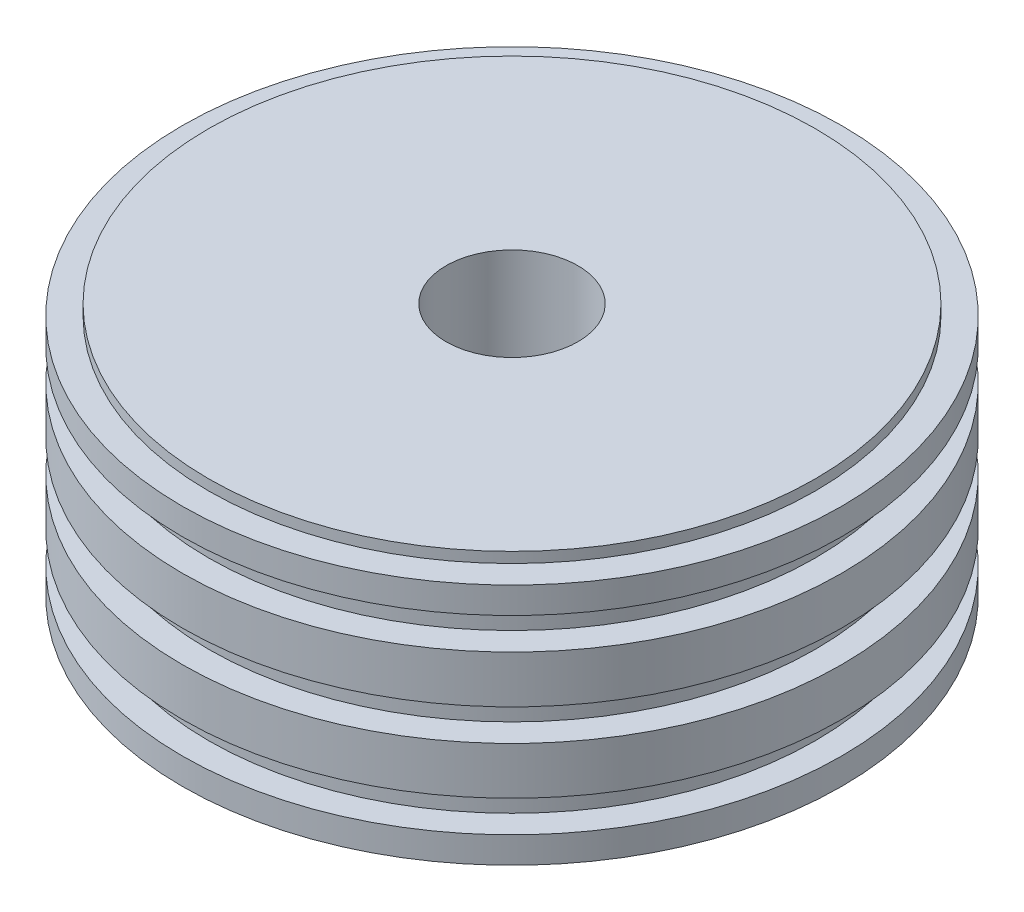
ISO-10303-21;
HEADER;
FILE_DESCRIPTION(('STEP AP214'),'2;1');
FILE_NAME('part.step','',(''),(''),'','','');
FILE_SCHEMA(('AUTOMOTIVE_DESIGN { 1 0 10303 214 1 1 1 1 }'));
ENDSEC;
DATA;
#1=APPLICATION_CONTEXT('core data for automotive mechanical design processes');
#2=APPLICATION_PROTOCOL_DEFINITION('international standard','automotive_design',2000,#1);
#3=PRODUCT_CONTEXT('',#1,'mechanical');
#4=PRODUCT('Part','Part','',(#3));
#5=PRODUCT_RELATED_PRODUCT_CATEGORY('part','',(#4));
#6=PRODUCT_DEFINITION_FORMATION('','',#4);
#7=PRODUCT_DEFINITION_CONTEXT('part definition',#1,'design');
#8=PRODUCT_DEFINITION('design','',#6,#7);
#9=PRODUCT_DEFINITION_SHAPE('','',#8);
#10=(LENGTH_UNIT() NAMED_UNIT(*) SI_UNIT(.MILLI.,.METRE.));
#11=(NAMED_UNIT(*) PLANE_ANGLE_UNIT() SI_UNIT($,.RADIAN.));
#12=(NAMED_UNIT(*) SI_UNIT($,.STERADIAN.) SOLID_ANGLE_UNIT());
#13=UNCERTAINTY_MEASURE_WITH_UNIT(LENGTH_MEASURE(1.E-05),#10,'distance_accuracy_value','');
#14=(GEOMETRIC_REPRESENTATION_CONTEXT(3) GLOBAL_UNCERTAINTY_ASSIGNED_CONTEXT((#13)) GLOBAL_UNIT_ASSIGNED_CONTEXT((#10,
#11,#12)) REPRESENTATION_CONTEXT('',''));
#15=CARTESIAN_POINT('',(0.,0.,0.));
#16=DIRECTION('',(0.,0.,1.));
#17=DIRECTION('',(1.,0.,0.));
#18=AXIS2_PLACEMENT_3D('',#15,#16,#17);
#19=CARTESIAN_POINT('',(0.,50.,0.));
#20=DIRECTION('',(0.,-1.,0.));
#21=DIRECTION('',(0.,0.,-1.));
#22=AXIS2_PLACEMENT_3D('',#19,#20,#21);
#23=CYLINDRICAL_SURFACE('',#22,62.5);
#24=CARTESIAN_POINT('',(0.,7.,0.));
#25=DIRECTION('',(0.,1.,0.));
#26=DIRECTION('',(0.,0.,1.));
#27=AXIS2_PLACEMENT_3D('',#24,#25,#26);
#28=CIRCLE('',#27,62.5);
#29=CARTESIAN_POINT('',(0.,7.,62.5));
#30=VERTEX_POINT('',#29);
#31=EDGE_CURVE('E61',#30,#30,#28,.T.);
#32=ORIENTED_EDGE('',*,*,#31,.F.);
#33=EDGE_LOOP('',(#32));
#34=FACE_BOUND('',#33,.T.);
#35=CARTESIAN_POINT('',(0.,2.,0.));
#36=DIRECTION('',(0.,-1.,0.));
#37=DIRECTION('',(0.,0.,-1.));
#38=AXIS2_PLACEMENT_3D('',#35,#36,#37);
#39=CIRCLE('',#38,62.5);
#40=CARTESIAN_POINT('',(0.,2.,-62.5));
#41=VERTEX_POINT('',#40);
#42=EDGE_CURVE('E88',#41,#41,#39,.T.);
#43=ORIENTED_EDGE('',*,*,#42,.F.);
#44=EDGE_LOOP('',(#43));
#45=FACE_BOUND('',#44,.T.);
#46=ADVANCED_FACE('F39',(#34,#45),#23,.T.);
#47=CARTESIAN_POINT('',(0.,43.,0.));
#48=DIRECTION('',(0.,1.,0.));
#49=DIRECTION('',(0.,0.,1.));
#50=AXIS2_PLACEMENT_3D('',#47,#48,#49);
#51=CIRCLE('',#50,62.5);
#52=CARTESIAN_POINT('',(0.,43.,62.5));
#53=VERTEX_POINT('',#52);
#54=EDGE_CURVE('E43',#53,#53,#51,.T.);
#55=ORIENTED_EDGE('',*,*,#54,.T.);
#56=EDGE_LOOP('',(#55));
#57=FACE_BOUND('',#56,.T.);
#58=CARTESIAN_POINT('',(0.,48.,0.));
#59=DIRECTION('',(0.,1.,0.));
#60=DIRECTION('',(0.,0.,1.));
#61=AXIS2_PLACEMENT_3D('',#58,#59,#60);
#62=CIRCLE('',#61,62.5);
#63=CARTESIAN_POINT('',(0.,48.,62.5));
#64=VERTEX_POINT('',#63);
#65=EDGE_CURVE('E69',#64,#64,#62,.T.);
#66=ORIENTED_EDGE('',*,*,#65,.F.);
#67=EDGE_LOOP('',(#66));
#68=FACE_BOUND('',#67,.T.);
#69=ADVANCED_FACE('F41',(#57,#68),#23,.T.);
#70=CARTESIAN_POINT('',(0.,28.,0.));
#71=DIRECTION('',(0.,1.,0.));
#72=DIRECTION('',(0.,0.,1.));
#73=AXIS2_PLACEMENT_3D('',#70,#71,#72);
#74=CIRCLE('',#73,62.5);
#75=CARTESIAN_POINT('',(0.,28.,62.5));
#76=VERTEX_POINT('',#75);
#77=EDGE_CURVE('E72',#76,#76,#74,.T.);
#78=ORIENTED_EDGE('',*,*,#77,.T.);
#79=EDGE_LOOP('',(#78));
#80=FACE_BOUND('',#79,.T.);
#81=CARTESIAN_POINT('',(0.,37.,0.));
#82=DIRECTION('',(0.,1.,0.));
#83=DIRECTION('',(0.,0.,1.));
#84=AXIS2_PLACEMENT_3D('',#81,#82,#83);
#85=CIRCLE('',#84,62.5);
#86=CARTESIAN_POINT('',(0.,37.,62.5));
#87=VERTEX_POINT('',#86);
#88=EDGE_CURVE('E10',#87,#87,#85,.T.);
#89=ORIENTED_EDGE('',*,*,#88,.F.);
#90=EDGE_LOOP('',(#89));
#91=FACE_BOUND('',#90,.T.);
#92=ADVANCED_FACE('F141',(#80,#91),#23,.T.);
#93=CARTESIAN_POINT('',(0.,37.,0.));
#94=DIRECTION('',(0.,1.,0.));
#95=DIRECTION('',(0.,0.,1.));
#96=AXIS2_PLACEMENT_3D('',#93,#94,#95);
#97=PLANE('',#96);
#98=CARTESIAN_POINT('',(0.,37.,0.));
#99=DIRECTION('',(0.,1.,0.));
#100=DIRECTION('',(0.,0.,1.));
#101=AXIS2_PLACEMENT_3D('',#98,#99,#100);
#102=CIRCLE('',#101,57.5);
#103=CARTESIAN_POINT('',(0.,37.,57.5));
#104=VERTEX_POINT('',#103);
#105=EDGE_CURVE('E50',#104,#104,#102,.T.);
#106=ORIENTED_EDGE('',*,*,#105,.F.);
#107=EDGE_LOOP('',(#106));
#108=FACE_BOUND('',#107,.T.);
#109=ORIENTED_EDGE('',*,*,#88,.T.);
#110=EDGE_LOOP('',(#109));
#111=FACE_BOUND('',#110,.T.);
#112=ADVANCED_FACE('F161',(#108,#111),#97,.T.);
#113=CARTESIAN_POINT('',(0.,43.,0.));
#114=DIRECTION('',(0.,1.,0.));
#115=DIRECTION('',(0.,0.,1.));
#116=AXIS2_PLACEMENT_3D('',#113,#114,#115);
#117=PLANE('',#116);
#118=CARTESIAN_POINT('',(0.,43.,0.));
#119=DIRECTION('',(0.,1.,0.));
#120=DIRECTION('',(0.,0.,1.));
#121=AXIS2_PLACEMENT_3D('',#118,#119,#120);
#122=CIRCLE('',#121,57.5);
#123=CARTESIAN_POINT('',(0.,43.,57.5));
#124=VERTEX_POINT('',#123);
#125=EDGE_CURVE('E52',#124,#124,#122,.T.);
#126=ORIENTED_EDGE('',*,*,#125,.T.);
#127=EDGE_LOOP('',(#126));
#128=FACE_BOUND('',#127,.T.);
#129=ORIENTED_EDGE('',*,*,#54,.F.);
#130=EDGE_LOOP('',(#129));
#131=FACE_BOUND('',#130,.T.);
#132=ADVANCED_FACE('F168',(#128,#131),#117,.F.);
#133=CARTESIAN_POINT('',(0.,37.,0.));
#134=DIRECTION('',(0.,1.,0.));
#135=DIRECTION('',(0.,0.,1.));
#136=AXIS2_PLACEMENT_3D('',#133,#134,#135);
#137=CYLINDRICAL_SURFACE('',#136,57.5);
#138=ORIENTED_EDGE('',*,*,#105,.T.);
#139=EDGE_LOOP('',(#138));
#140=FACE_BOUND('',#139,.T.);
#141=ORIENTED_EDGE('',*,*,#125,.F.);
#142=EDGE_LOOP('',(#141));
#143=FACE_BOUND('',#142,.T.);
#144=ADVANCED_FACE('F180',(#140,#143),#137,.T.);
#145=CARTESIAN_POINT('',(0.,22.,0.));
#146=DIRECTION('',(0.,1.,0.));
#147=DIRECTION('',(0.,0.,1.));
#148=AXIS2_PLACEMENT_3D('',#145,#146,#147);
#149=PLANE('',#148);
#150=CARTESIAN_POINT('',(0.,22.,0.));
#151=DIRECTION('',(0.,1.,0.));
#152=DIRECTION('',(0.,0.,1.));
#153=AXIS2_PLACEMENT_3D('',#150,#151,#152);
#154=CIRCLE('',#153,57.5);
#155=CARTESIAN_POINT('',(0.,22.,57.5));
#156=VERTEX_POINT('',#155);
#157=EDGE_CURVE('E75',#156,#156,#154,.T.);
#158=ORIENTED_EDGE('',*,*,#157,.F.);
#159=EDGE_LOOP('',(#158));
#160=FACE_BOUND('',#159,.T.);
#161=CARTESIAN_POINT('',(0.,22.,0.));
#162=DIRECTION('',(0.,1.,0.));
#163=DIRECTION('',(0.,0.,1.));
#164=AXIS2_PLACEMENT_3D('',#161,#162,#163);
#165=CIRCLE('',#164,62.5);
#166=CARTESIAN_POINT('',(0.,22.,62.5));
#167=VERTEX_POINT('',#166);
#168=EDGE_CURVE('E55',#167,#167,#165,.T.);
#169=ORIENTED_EDGE('',*,*,#168,.T.);
#170=EDGE_LOOP('',(#169));
#171=FACE_BOUND('',#170,.T.);
#172=ADVANCED_FACE('F175',(#160,#171),#149,.T.);
#173=CARTESIAN_POINT('',(0.,28.,0.));
#174=DIRECTION('',(0.,1.,0.));
#175=DIRECTION('',(0.,0.,1.));
#176=AXIS2_PLACEMENT_3D('',#173,#174,#175);
#177=PLANE('',#176);
#178=CARTESIAN_POINT('',(0.,28.,0.));
#179=DIRECTION('',(0.,1.,0.));
#180=DIRECTION('',(0.,0.,1.));
#181=AXIS2_PLACEMENT_3D('',#178,#179,#180);
#182=CIRCLE('',#181,57.5);
#183=CARTESIAN_POINT('',(0.,28.,57.5));
#184=VERTEX_POINT('',#183);
#185=EDGE_CURVE('E65',#184,#184,#182,.T.);
#186=ORIENTED_EDGE('',*,*,#185,.T.);
#187=EDGE_LOOP('',(#186));
#188=FACE_BOUND('',#187,.T.);
#189=ORIENTED_EDGE('',*,*,#77,.F.);
#190=EDGE_LOOP('',(#189));
#191=FACE_BOUND('',#190,.T.);
#192=ADVANCED_FACE('F156',(#188,#191),#177,.F.);
#193=CARTESIAN_POINT('',(0.,22.,0.));
#194=DIRECTION('',(0.,1.,0.));
#195=DIRECTION('',(0.,0.,1.));
#196=AXIS2_PLACEMENT_3D('',#193,#194,#195);
#197=CYLINDRICAL_SURFACE('',#196,57.5);
#198=ORIENTED_EDGE('',*,*,#157,.T.);
#199=EDGE_LOOP('',(#198));
#200=FACE_BOUND('',#199,.T.);
#201=ORIENTED_EDGE('',*,*,#185,.F.);
#202=EDGE_LOOP('',(#201));
#203=FACE_BOUND('',#202,.T.);
#204=ADVANCED_FACE('F147',(#200,#203),#197,.T.);
#205=CARTESIAN_POINT('',(0.,13.,0.));
#206=DIRECTION('',(0.,1.,0.));
#207=DIRECTION('',(0.,0.,1.));
#208=AXIS2_PLACEMENT_3D('',#205,#206,#207);
#209=CIRCLE('',#208,62.5);
#210=CARTESIAN_POINT('',(0.,13.,62.5));
#211=VERTEX_POINT('',#210);
#212=EDGE_CURVE('E58',#211,#211,#209,.T.);
#213=ORIENTED_EDGE('',*,*,#212,.T.);
#214=EDGE_LOOP('',(#213));
#215=FACE_BOUND('',#214,.T.);
#216=ORIENTED_EDGE('',*,*,#168,.F.);
#217=EDGE_LOOP('',(#216));
#218=FACE_BOUND('',#217,.T.);
#219=ADVANCED_FACE('F136',(#215,#218),#23,.T.);
#220=CARTESIAN_POINT('',(0.,7.,0.));
#221=DIRECTION('',(0.,1.,0.));
#222=DIRECTION('',(0.,0.,1.));
#223=AXIS2_PLACEMENT_3D('',#220,#221,#222);
#224=PLANE('',#223);
#225=CARTESIAN_POINT('',(0.,7.,0.));
#226=DIRECTION('',(0.,1.,0.));
#227=DIRECTION('',(0.,0.,1.));
#228=AXIS2_PLACEMENT_3D('',#225,#226,#227);
#229=CIRCLE('',#228,57.5);
#230=CARTESIAN_POINT('',(0.,7.,57.5));
#231=VERTEX_POINT('',#230);
#232=EDGE_CURVE('E62',#231,#231,#229,.T.);
#233=ORIENTED_EDGE('',*,*,#232,.F.);
#234=EDGE_LOOP('',(#233));
#235=FACE_BOUND('',#234,.T.);
#236=ORIENTED_EDGE('',*,*,#31,.T.);
#237=EDGE_LOOP('',(#236));
#238=FACE_BOUND('',#237,.T.);
#239=ADVANCED_FACE('F146',(#235,#238),#224,.T.);
#240=CARTESIAN_POINT('',(0.,13.,0.));
#241=DIRECTION('',(0.,1.,0.));
#242=DIRECTION('',(0.,0.,1.));
#243=AXIS2_PLACEMENT_3D('',#240,#241,#242);
#244=PLANE('',#243);
#245=CARTESIAN_POINT('',(0.,13.,0.));
#246=DIRECTION('',(0.,1.,0.));
#247=DIRECTION('',(0.,0.,1.));
#248=AXIS2_PLACEMENT_3D('',#245,#246,#247);
#249=CIRCLE('',#248,57.5);
#250=CARTESIAN_POINT('',(0.,13.,57.5));
#251=VERTEX_POINT('',#250);
#252=EDGE_CURVE('E66',#251,#251,#249,.T.);
#253=ORIENTED_EDGE('',*,*,#252,.T.);
#254=EDGE_LOOP('',(#253));
#255=FACE_BOUND('',#254,.T.);
#256=ORIENTED_EDGE('',*,*,#212,.F.);
#257=EDGE_LOOP('',(#256));
#258=FACE_BOUND('',#257,.T.);
#259=ADVANCED_FACE('F153',(#255,#258),#244,.F.);
#260=CARTESIAN_POINT('',(0.,7.,0.));
#261=DIRECTION('',(0.,1.,0.));
#262=DIRECTION('',(0.,0.,1.));
#263=AXIS2_PLACEMENT_3D('',#260,#261,#262);
#264=CYLINDRICAL_SURFACE('',#263,57.5);
#265=ORIENTED_EDGE('',*,*,#232,.T.);
#266=EDGE_LOOP('',(#265));
#267=FACE_BOUND('',#266,.T.);
#268=ORIENTED_EDGE('',*,*,#252,.F.);
#269=EDGE_LOOP('',(#268));
#270=FACE_BOUND('',#269,.T.);
#271=ADVANCED_FACE('F131',(#267,#270),#264,.T.);
#272=CARTESIAN_POINT('',(0.,48.,0.));
#273=DIRECTION('',(0.,1.,0.));
#274=DIRECTION('',(0.,0.,1.));
#275=AXIS2_PLACEMENT_3D('',#272,#273,#274);
#276=PLANE('',#275);
#277=CARTESIAN_POINT('',(0.,48.,0.));
#278=DIRECTION('',(0.,1.,0.));
#279=DIRECTION('',(0.,0.,1.));
#280=AXIS2_PLACEMENT_3D('',#277,#278,#279);
#281=CIRCLE('',#280,57.5);
#282=CARTESIAN_POINT('',(0.,48.,57.5));
#283=VERTEX_POINT('',#282);
#284=EDGE_CURVE('E84',#283,#283,#281,.T.);
#285=ORIENTED_EDGE('',*,*,#284,.F.);
#286=EDGE_LOOP('',(#285));
#287=FACE_BOUND('',#286,.T.);
#288=ORIENTED_EDGE('',*,*,#65,.T.);
#289=EDGE_LOOP('',(#288));
#290=FACE_BOUND('',#289,.T.);
#291=ADVANCED_FACE('F124',(#287,#290),#276,.T.);
#292=CARTESIAN_POINT('',(0.,48.,0.));
#293=DIRECTION('',(0.,1.,0.));
#294=DIRECTION('',(0.,0.,1.));
#295=AXIS2_PLACEMENT_3D('',#292,#293,#294);
#296=CYLINDRICAL_SURFACE('',#295,57.5);
#297=ORIENTED_EDGE('',*,*,#284,.T.);
#298=EDGE_LOOP('',(#297));
#299=FACE_BOUND('',#298,.T.);
#300=CARTESIAN_POINT('',(0.,50.,0.));
#301=DIRECTION('',(0.,1.,0.));
#302=DIRECTION('',(0.,0.,1.));
#303=AXIS2_PLACEMENT_3D('',#300,#301,#302);
#304=CIRCLE('',#303,57.5);
#305=CARTESIAN_POINT('',(0.,50.,57.5));
#306=VERTEX_POINT('',#305);
#307=EDGE_CURVE('E85',#306,#306,#304,.T.);
#308=ORIENTED_EDGE('',*,*,#307,.F.);
#309=EDGE_LOOP('',(#308));
#310=FACE_BOUND('',#309,.T.);
#311=ADVANCED_FACE('F119',(#299,#310),#296,.T.);
#312=CARTESIAN_POINT('',(0.,50.,0.));
#313=DIRECTION('',(0.,1.,0.));
#314=DIRECTION('',(0.,0.,1.));
#315=AXIS2_PLACEMENT_3D('',#312,#313,#314);
#316=PLANE('',#315);
#317=CARTESIAN_POINT('',(0.,50.,0.));
#318=DIRECTION('',(0.,1.,0.));
#319=DIRECTION('',(0.,0.,1.));
#320=AXIS2_PLACEMENT_3D('',#317,#318,#319);
#321=CIRCLE('',#320,12.5);
#322=CARTESIAN_POINT('',(0.,50.,12.5));
#323=VERTEX_POINT('',#322);
#324=EDGE_CURVE('E100',#323,#323,#321,.T.);
#325=ORIENTED_EDGE('',*,*,#324,.F.);
#326=EDGE_LOOP('',(#325));
#327=FACE_BOUND('',#326,.T.);
#328=ORIENTED_EDGE('',*,*,#307,.T.);
#329=EDGE_LOOP('',(#328));
#330=FACE_BOUND('',#329,.T.);
#331=ADVANCED_FACE('F115',(#327,#330),#316,.T.);
#332=CARTESIAN_POINT('',(0.,2.,0.));
#333=DIRECTION('',(0.,-1.,0.));
#334=DIRECTION('',(0.,0.,-1.));
#335=AXIS2_PLACEMENT_3D('',#332,#333,#334);
#336=PLANE('',#335);
#337=CARTESIAN_POINT('',(0.,2.,0.));
#338=DIRECTION('',(0.,-1.,0.));
#339=DIRECTION('',(0.,0.,-1.));
#340=AXIS2_PLACEMENT_3D('',#337,#338,#339);
#341=CIRCLE('',#340,57.5);
#342=CARTESIAN_POINT('',(0.,2.,-57.5));
#343=VERTEX_POINT('',#342);
#344=EDGE_CURVE('E93',#343,#343,#341,.T.);
#345=ORIENTED_EDGE('',*,*,#344,.F.);
#346=EDGE_LOOP('',(#345));
#347=FACE_BOUND('',#346,.T.);
#348=ORIENTED_EDGE('',*,*,#42,.T.);
#349=EDGE_LOOP('',(#348));
#350=FACE_BOUND('',#349,.T.);
#351=ADVANCED_FACE('F118',(#347,#350),#336,.T.);
#352=CARTESIAN_POINT('',(0.,2.,0.));
#353=DIRECTION('',(0.,-1.,0.));
#354=DIRECTION('',(0.,0.,-1.));
#355=AXIS2_PLACEMENT_3D('',#352,#353,#354);
#356=CYLINDRICAL_SURFACE('',#355,57.5);
#357=ORIENTED_EDGE('',*,*,#344,.T.);
#358=EDGE_LOOP('',(#357));
#359=FACE_BOUND('',#358,.T.);
#360=CARTESIAN_POINT('',(0.,0.,0.));
#361=DIRECTION('',(0.,-1.,0.));
#362=DIRECTION('',(0.,0.,-1.));
#363=AXIS2_PLACEMENT_3D('',#360,#361,#362);
#364=CIRCLE('',#363,57.5);
#365=CARTESIAN_POINT('',(0.,0.,-57.5));
#366=VERTEX_POINT('',#365);
#367=EDGE_CURVE('E94',#366,#366,#364,.T.);
#368=ORIENTED_EDGE('',*,*,#367,.F.);
#369=EDGE_LOOP('',(#368));
#370=FACE_BOUND('',#369,.T.);
#371=ADVANCED_FACE('F195',(#359,#370),#356,.T.);
#372=CARTESIAN_POINT('',(0.,0.,0.));
#373=DIRECTION('',(0.,1.,0.));
#374=DIRECTION('',(0.,0.,1.));
#375=AXIS2_PLACEMENT_3D('',#372,#373,#374);
#376=PLANE('',#375);
#377=CARTESIAN_POINT('',(0.,0.,0.));
#378=DIRECTION('',(0.,1.,0.));
#379=DIRECTION('',(0.,0.,1.));
#380=AXIS2_PLACEMENT_3D('',#377,#378,#379);
#381=CIRCLE('',#380,12.5);
#382=CARTESIAN_POINT('',(0.,0.,12.5));
#383=VERTEX_POINT('',#382);
#384=EDGE_CURVE('E97',#383,#383,#381,.T.);
#385=ORIENTED_EDGE('',*,*,#384,.T.);
#386=EDGE_LOOP('',(#385));
#387=FACE_BOUND('',#386,.T.);
#388=ORIENTED_EDGE('',*,*,#367,.T.);
#389=EDGE_LOOP('',(#388));
#390=FACE_BOUND('',#389,.T.);
#391=ADVANCED_FACE('F106',(#387,#390),#376,.F.);
#392=CARTESIAN_POINT('',(0.,0.,0.));
#393=DIRECTION('',(0.,1.,0.));
#394=DIRECTION('',(0.,0.,1.));
#395=AXIS2_PLACEMENT_3D('',#392,#393,#394);
#396=CYLINDRICAL_SURFACE('',#395,12.5);
#397=ORIENTED_EDGE('',*,*,#384,.F.);
#398=EDGE_LOOP('',(#397));
#399=FACE_BOUND('',#398,.T.);
#400=ORIENTED_EDGE('',*,*,#324,.T.);
#401=EDGE_LOOP('',(#400));
#402=FACE_BOUND('',#401,.T.);
#403=ADVANCED_FACE('F109',(#399,#402),#396,.F.);
#404=CLOSED_SHELL('',(#46,#69,#92,#112,#132,#144,#172,#192,#204,#219,#239,#259,#271,#291,#311,
#331,#351,#371,#391,#403));
#405=MANIFOLD_SOLID_BREP('B2',#404);
#406=ADVANCED_BREP_SHAPE_REPRESENTATION('',(#18,#405),#14);
#407=SHAPE_DEFINITION_REPRESENTATION(#9,#406);
ENDSEC;
END-ISO-10303-21;
